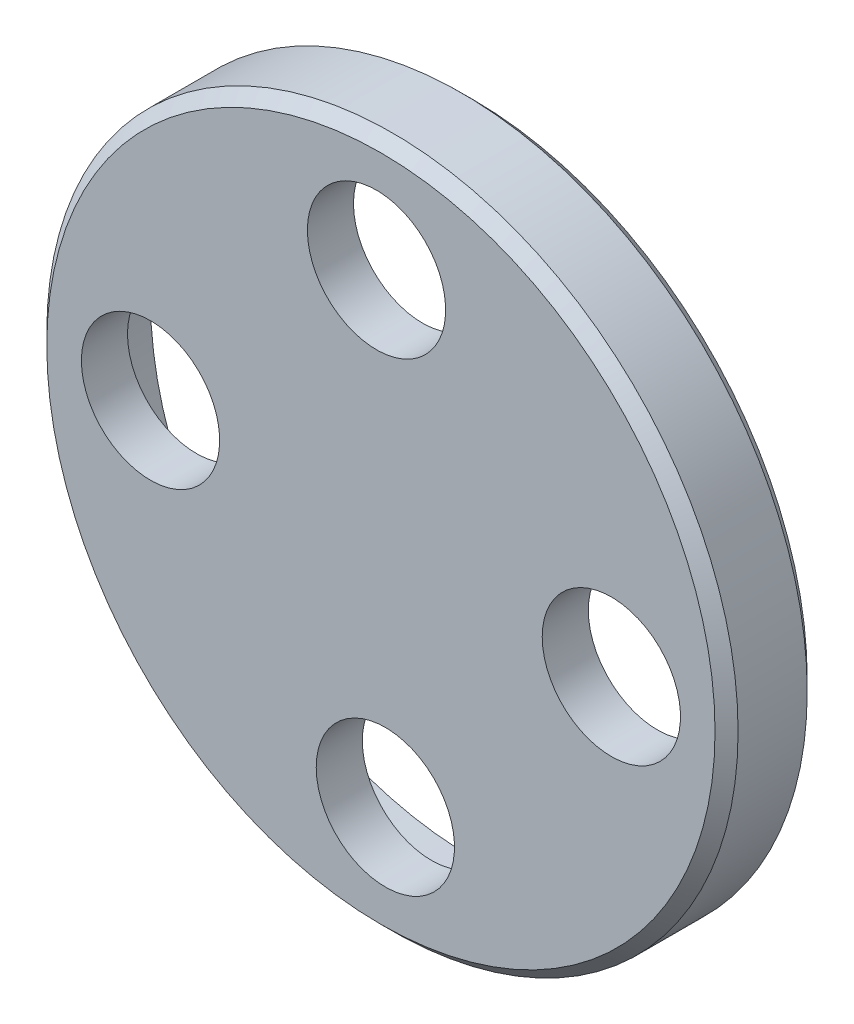
ISO-10303-21;
HEADER;
FILE_DESCRIPTION(('STEP AP214'),'2;1');
FILE_NAME('part.step','',(''),(''),'','','');
FILE_SCHEMA(('AUTOMOTIVE_DESIGN { 1 0 10303 214 1 1 1 1 }'));
ENDSEC;
DATA;
#1=APPLICATION_CONTEXT('core data for automotive mechanical design processes');
#2=APPLICATION_PROTOCOL_DEFINITION('international standard','automotive_design',2000,#1);
#3=PRODUCT_CONTEXT('',#1,'mechanical');
#4=PRODUCT('Part','Part','',(#3));
#5=PRODUCT_RELATED_PRODUCT_CATEGORY('part','',(#4));
#6=PRODUCT_DEFINITION_FORMATION('','',#4);
#7=PRODUCT_DEFINITION_CONTEXT('part definition',#1,'design');
#8=PRODUCT_DEFINITION('design','',#6,#7);
#9=PRODUCT_DEFINITION_SHAPE('','',#8);
#10=(LENGTH_UNIT() NAMED_UNIT(*) SI_UNIT(.MILLI.,.METRE.));
#11=(NAMED_UNIT(*) PLANE_ANGLE_UNIT() SI_UNIT($,.RADIAN.));
#12=(NAMED_UNIT(*) SI_UNIT($,.STERADIAN.) SOLID_ANGLE_UNIT());
#13=UNCERTAINTY_MEASURE_WITH_UNIT(LENGTH_MEASURE(1.E-05),#10,'distance_accuracy_value','');
#14=(GEOMETRIC_REPRESENTATION_CONTEXT(3) GLOBAL_UNCERTAINTY_ASSIGNED_CONTEXT((#13)) GLOBAL_UNIT_ASSIGNED_CONTEXT((#10,
#11,#12)) REPRESENTATION_CONTEXT('',''));
#15=CARTESIAN_POINT('',(0.,0.,0.));
#16=DIRECTION('',(0.,0.,1.));
#17=DIRECTION('',(1.,0.,0.));
#18=AXIS2_PLACEMENT_3D('',#15,#16,#17);
#19=CARTESIAN_POINT('',(0.,0.,4.));
#20=DIRECTION('',(0.,0.,-1.));
#21=DIRECTION('',(-1.,0.,0.));
#22=AXIS2_PLACEMENT_3D('',#19,#20,#21);
#23=CYLINDRICAL_SURFACE('',#22,15.);
#24=CARTESIAN_POINT('',(0.,0.,0.500000000000006));
#25=DIRECTION('',(0.,0.,1.));
#26=DIRECTION('',(1.,0.,0.));
#27=AXIS2_PLACEMENT_3D('',#24,#25,#26);
#28=CIRCLE('',#27,15.);
#29=CARTESIAN_POINT('',(15.,0.,0.500000000000006));
#30=VERTEX_POINT('',#29);
#31=EDGE_CURVE('E37',#30,#30,#28,.T.);
#32=ORIENTED_EDGE('',*,*,#31,.T.);
#33=EDGE_LOOP('',(#32));
#34=FACE_BOUND('',#33,.T.);
#35=CARTESIAN_POINT('',(0.,0.,3.5));
#36=DIRECTION('',(0.,0.,1.));
#37=DIRECTION('',(1.,0.,0.));
#38=AXIS2_PLACEMENT_3D('',#35,#36,#37);
#39=CIRCLE('',#38,15.);
#40=CARTESIAN_POINT('',(15.,0.,3.5));
#41=VERTEX_POINT('',#40);
#42=EDGE_CURVE('E41',#41,#41,#39,.F.);
#43=ORIENTED_EDGE('',*,*,#42,.T.);
#44=EDGE_LOOP('',(#43));
#45=FACE_BOUND('',#44,.T.);
#46=ADVANCED_FACE('F30',(#34,#45),#23,.T.);
#47=CARTESIAN_POINT('',(0.,0.,4.));
#48=DIRECTION('',(0.,0.,1.));
#49=DIRECTION('',(1.,0.,0.));
#50=AXIS2_PLACEMENT_3D('',#47,#48,#49);
#51=PLANE('',#50);
#52=CARTESIAN_POINT('',(0.,0.,4.));
#53=DIRECTION('',(0.,0.,1.));
#54=DIRECTION('',(1.,0.,0.));
#55=AXIS2_PLACEMENT_3D('',#52,#53,#54);
#56=CIRCLE('',#55,14.5);
#57=CARTESIAN_POINT('',(14.5,0.,4.));
#58=VERTEX_POINT('',#57);
#59=EDGE_CURVE('E45',#58,#58,#56,.T.);
#60=ORIENTED_EDGE('',*,*,#59,.T.);
#61=EDGE_LOOP('',(#60));
#62=FACE_BOUND('',#61,.T.);
#63=CARTESIAN_POINT('',(10.,-0.190866700158382,4.));
#64=DIRECTION('',(0.,0.,-1.));
#65=DIRECTION('',(-1.,0.,0.));
#66=AXIS2_PLACEMENT_3D('',#63,#64,#65);
#67=CIRCLE('',#66,3.);
#68=CARTESIAN_POINT('',(7.,-0.190866700158382,4.));
#69=VERTEX_POINT('',#68);
#70=EDGE_CURVE('E72',#69,#69,#67,.T.);
#71=ORIENTED_EDGE('',*,*,#70,.T.);
#72=EDGE_LOOP('',(#71));
#73=FACE_BOUND('',#72,.T.);
#74=CARTESIAN_POINT('',(-0.190866700161899,10.,4.));
#75=DIRECTION('',(0.,0.,-1.));
#76=DIRECTION('',(-1.,0.,0.));
#77=AXIS2_PLACEMENT_3D('',#74,#75,#76);
#78=CIRCLE('',#77,3.);
#79=CARTESIAN_POINT('',(-3.1908667001619,10.,4.));
#80=VERTEX_POINT('',#79);
#81=EDGE_CURVE('E66',#80,#80,#78,.T.);
#82=ORIENTED_EDGE('',*,*,#81,.T.);
#83=EDGE_LOOP('',(#82));
#84=FACE_BOUND('',#83,.T.);
#85=CARTESIAN_POINT('',(0.192723999641794,-9.99814270052004,4.));
#86=DIRECTION('',(0.,0.,-1.));
#87=DIRECTION('',(-1.,0.,0.));
#88=AXIS2_PLACEMENT_3D('',#85,#86,#87);
#89=CIRCLE('',#88,3.);
#90=CARTESIAN_POINT('',(-2.80727600035821,-9.99814270052004,4.));
#91=VERTEX_POINT('',#90);
#92=EDGE_CURVE('E60',#91,#91,#89,.T.);
#93=ORIENTED_EDGE('',*,*,#92,.T.);
#94=EDGE_LOOP('',(#93));
#95=FACE_BOUND('',#94,.T.);
#96=CARTESIAN_POINT('',(-9.99814270052011,0.192723999638344,4.));
#97=DIRECTION('',(0.,0.,-1.));
#98=DIRECTION('',(-1.,0.,0.));
#99=AXIS2_PLACEMENT_3D('',#96,#97,#98);
#100=CIRCLE('',#99,3.);
#101=CARTESIAN_POINT('',(-12.9981427005201,0.192723999638344,4.));
#102=VERTEX_POINT('',#101);
#103=EDGE_CURVE('E54',#102,#102,#100,.T.);
#104=ORIENTED_EDGE('',*,*,#103,.T.);
#105=EDGE_LOOP('',(#104));
#106=FACE_BOUND('',#105,.T.);
#107=ADVANCED_FACE('F81',(#62,#73,#84,#95,#106),#51,.T.);
#108=CARTESIAN_POINT('',(0.,0.,0.));
#109=DIRECTION('',(0.,0.,1.));
#110=DIRECTION('',(1.,0.,0.));
#111=AXIS2_PLACEMENT_3D('',#108,#109,#110);
#112=PLANE('',#111);
#113=CARTESIAN_POINT('',(0.,0.,0.));
#114=DIRECTION('',(0.,0.,1.));
#115=DIRECTION('',(1.,0.,0.));
#116=AXIS2_PLACEMENT_3D('',#113,#114,#115);
#117=CIRCLE('',#116,14.5);
#118=CARTESIAN_POINT('',(14.5,0.,0.));
#119=VERTEX_POINT('',#118);
#120=EDGE_CURVE('E10',#119,#119,#117,.F.);
#121=ORIENTED_EDGE('',*,*,#120,.T.);
#122=EDGE_LOOP('',(#121));
#123=FACE_BOUND('',#122,.T.);
#124=CARTESIAN_POINT('',(0.,0.,0.));
#125=DIRECTION('',(0.,0.,-1.));
#126=DIRECTION('',(-1.,0.,0.));
#127=AXIS2_PLACEMENT_3D('',#124,#125,#126);
#128=CIRCLE('',#127,14.);
#129=CARTESIAN_POINT('',(-14.,0.,0.));
#130=VERTEX_POINT('',#129);
#131=EDGE_CURVE('E51',#130,#130,#128,.T.);
#132=ORIENTED_EDGE('',*,*,#131,.F.);
#133=EDGE_LOOP('',(#132));
#134=FACE_BOUND('',#133,.T.);
#135=ADVANCED_FACE('F108',(#123,#134),#112,.F.);
#136=CARTESIAN_POINT('',(0.,0.,2.));
#137=DIRECTION('',(0.,0.,-1.));
#138=DIRECTION('',(-1.,0.,0.));
#139=AXIS2_PLACEMENT_3D('',#136,#137,#138);
#140=CYLINDRICAL_SURFACE('',#139,14.);
#141=CARTESIAN_POINT('',(0.,0.,2.));
#142=DIRECTION('',(0.,0.,-1.));
#143=DIRECTION('',(-1.,0.,0.));
#144=AXIS2_PLACEMENT_3D('',#141,#142,#143);
#145=CIRCLE('',#144,14.);
#146=CARTESIAN_POINT('',(-14.,0.,2.));
#147=VERTEX_POINT('',#146);
#148=EDGE_CURVE('E50',#147,#147,#145,.T.);
#149=ORIENTED_EDGE('',*,*,#148,.F.);
#150=EDGE_LOOP('',(#149));
#151=FACE_BOUND('',#150,.T.);
#152=ORIENTED_EDGE('',*,*,#131,.T.);
#153=EDGE_LOOP('',(#152));
#154=FACE_BOUND('',#153,.T.);
#155=ADVANCED_FACE('F96',(#151,#154),#140,.F.);
#156=CARTESIAN_POINT('',(0.,0.,2.));
#157=DIRECTION('',(0.,0.,-1.));
#158=DIRECTION('',(-1.,0.,0.));
#159=AXIS2_PLACEMENT_3D('',#156,#157,#158);
#160=PLANE('',#159);
#161=CARTESIAN_POINT('',(10.,-0.190866700158382,2.));
#162=DIRECTION('',(0.,0.,-1.));
#163=DIRECTION('',(-1.,0.,0.));
#164=AXIS2_PLACEMENT_3D('',#161,#162,#163);
#165=CIRCLE('',#164,3.);
#166=CARTESIAN_POINT('',(7.,-0.190866700158382,2.));
#167=VERTEX_POINT('',#166);
#168=EDGE_CURVE('E75',#167,#167,#165,.T.);
#169=ORIENTED_EDGE('',*,*,#168,.F.);
#170=EDGE_LOOP('',(#169));
#171=FACE_BOUND('',#170,.T.);
#172=CARTESIAN_POINT('',(-0.190866700161899,10.,2.));
#173=DIRECTION('',(0.,0.,-1.));
#174=DIRECTION('',(-1.,0.,0.));
#175=AXIS2_PLACEMENT_3D('',#172,#173,#174);
#176=CIRCLE('',#175,3.);
#177=CARTESIAN_POINT('',(-3.1908667001619,10.,2.));
#178=VERTEX_POINT('',#177);
#179=EDGE_CURVE('E69',#178,#178,#176,.T.);
#180=ORIENTED_EDGE('',*,*,#179,.F.);
#181=EDGE_LOOP('',(#180));
#182=FACE_BOUND('',#181,.T.);
#183=CARTESIAN_POINT('',(0.192723999641794,-9.99814270052004,2.));
#184=DIRECTION('',(0.,0.,-1.));
#185=DIRECTION('',(-1.,0.,0.));
#186=AXIS2_PLACEMENT_3D('',#183,#184,#185);
#187=CIRCLE('',#186,3.);
#188=CARTESIAN_POINT('',(-2.80727600035821,-9.99814270052004,2.));
#189=VERTEX_POINT('',#188);
#190=EDGE_CURVE('E63',#189,#189,#187,.T.);
#191=ORIENTED_EDGE('',*,*,#190,.F.);
#192=EDGE_LOOP('',(#191));
#193=FACE_BOUND('',#192,.T.);
#194=CARTESIAN_POINT('',(-9.99814270052011,0.192723999638344,2.));
#195=DIRECTION('',(0.,0.,-1.));
#196=DIRECTION('',(-1.,0.,0.));
#197=AXIS2_PLACEMENT_3D('',#194,#195,#196);
#198=CIRCLE('',#197,3.);
#199=CARTESIAN_POINT('',(-12.9981427005201,0.192723999638344,2.));
#200=VERTEX_POINT('',#199);
#201=EDGE_CURVE('E57',#200,#200,#198,.T.);
#202=ORIENTED_EDGE('',*,*,#201,.F.);
#203=EDGE_LOOP('',(#202));
#204=FACE_BOUND('',#203,.T.);
#205=ORIENTED_EDGE('',*,*,#148,.T.);
#206=EDGE_LOOP('',(#205));
#207=FACE_BOUND('',#206,.T.);
#208=ADVANCED_FACE('F92',(#171,#182,#193,#204,#207),#160,.T.);
#209=CARTESIAN_POINT('',(-9.99814270052011,0.192723999638344,4.));
#210=DIRECTION('',(0.,0.,-1.));
#211=DIRECTION('',(-1.,0.,0.));
#212=AXIS2_PLACEMENT_3D('',#209,#210,#211);
#213=CYLINDRICAL_SURFACE('',#212,3.);
#214=ORIENTED_EDGE('',*,*,#103,.F.);
#215=EDGE_LOOP('',(#214));
#216=FACE_BOUND('',#215,.T.);
#217=ORIENTED_EDGE('',*,*,#201,.T.);
#218=EDGE_LOOP('',(#217));
#219=FACE_BOUND('',#218,.T.);
#220=ADVANCED_FACE('F95',(#216,#219),#213,.F.);
#221=CARTESIAN_POINT('',(0.192723999641794,-9.99814270052004,4.));
#222=DIRECTION('',(0.,0.,-1.));
#223=DIRECTION('',(-1.,0.,0.));
#224=AXIS2_PLACEMENT_3D('',#221,#222,#223);
#225=CYLINDRICAL_SURFACE('',#224,3.);
#226=ORIENTED_EDGE('',*,*,#92,.F.);
#227=EDGE_LOOP('',(#226));
#228=FACE_BOUND('',#227,.T.);
#229=ORIENTED_EDGE('',*,*,#190,.T.);
#230=EDGE_LOOP('',(#229));
#231=FACE_BOUND('',#230,.T.);
#232=ADVANCED_FACE('F170',(#228,#231),#225,.F.);
#233=CARTESIAN_POINT('',(-0.190866700161899,10.,4.));
#234=DIRECTION('',(0.,0.,-1.));
#235=DIRECTION('',(-1.,0.,0.));
#236=AXIS2_PLACEMENT_3D('',#233,#234,#235);
#237=CYLINDRICAL_SURFACE('',#236,3.);
#238=ORIENTED_EDGE('',*,*,#81,.F.);
#239=EDGE_LOOP('',(#238));
#240=FACE_BOUND('',#239,.T.);
#241=ORIENTED_EDGE('',*,*,#179,.T.);
#242=EDGE_LOOP('',(#241));
#243=FACE_BOUND('',#242,.T.);
#244=ADVANCED_FACE('F88',(#240,#243),#237,.F.);
#245=CARTESIAN_POINT('',(10.,-0.190866700158382,4.));
#246=DIRECTION('',(0.,0.,-1.));
#247=DIRECTION('',(-1.,0.,0.));
#248=AXIS2_PLACEMENT_3D('',#245,#246,#247);
#249=CYLINDRICAL_SURFACE('',#248,3.);
#250=ORIENTED_EDGE('',*,*,#70,.F.);
#251=EDGE_LOOP('',(#250));
#252=FACE_BOUND('',#251,.T.);
#253=ORIENTED_EDGE('',*,*,#168,.T.);
#254=EDGE_LOOP('',(#253));
#255=FACE_BOUND('',#254,.T.);
#256=ADVANCED_FACE('F84',(#252,#255),#249,.F.);
#257=CARTESIAN_POINT('',(0.,0.,4.));
#258=DIRECTION('',(0.,0.,-1.));
#259=DIRECTION('',(-1.,0.,0.));
#260=AXIS2_PLACEMENT_3D('',#257,#258,#259);
#261=CONICAL_SURFACE('',#260,14.5,0.785398163397445);
#262=ORIENTED_EDGE('',*,*,#42,.F.);
#263=EDGE_LOOP('',(#262));
#264=FACE_BOUND('',#263,.T.);
#265=ORIENTED_EDGE('',*,*,#59,.F.);
#266=EDGE_LOOP('',(#265));
#267=FACE_BOUND('',#266,.T.);
#268=ADVANCED_FACE('F87',(#264,#267),#261,.T.);
#269=CARTESIAN_POINT('',(0.,0.,0.500000000000006));
#270=DIRECTION('',(0.,0.,1.));
#271=DIRECTION('',(1.,0.,0.));
#272=AXIS2_PLACEMENT_3D('',#269,#270,#271);
#273=CONICAL_SURFACE('',#272,15.,0.785398163397452);
#274=ORIENTED_EDGE('',*,*,#120,.F.);
#275=EDGE_LOOP('',(#274));
#276=FACE_BOUND('',#275,.T.);
#277=ORIENTED_EDGE('',*,*,#31,.F.);
#278=EDGE_LOOP('',(#277));
#279=FACE_BOUND('',#278,.T.);
#280=ADVANCED_FACE('F32',(#276,#279),#273,.T.);
#281=CLOSED_SHELL('',(#46,#107,#135,#155,#208,#220,#232,#244,#256,#268,#280));
#282=MANIFOLD_SOLID_BREP('B2',#281);
#283=ADVANCED_BREP_SHAPE_REPRESENTATION('',(#18,#282),#14);
#284=SHAPE_DEFINITION_REPRESENTATION(#9,#283);
ENDSEC;
END-ISO-10303-21;
